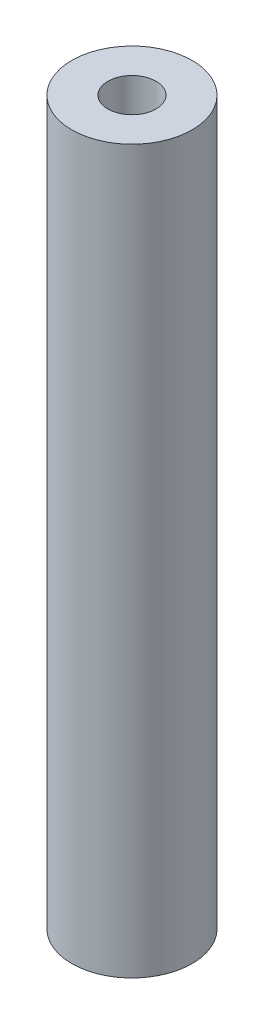
ISO-10303-21;
HEADER;
FILE_DESCRIPTION(('STEP AP214'),'2;1');
FILE_NAME('part.step','',(''),(''),'','','');
FILE_SCHEMA(('AUTOMOTIVE_DESIGN { 1 0 10303 214 1 1 1 1 }'));
ENDSEC;
DATA;
#1=APPLICATION_CONTEXT('core data for automotive mechanical design processes');
#2=APPLICATION_PROTOCOL_DEFINITION('international standard','automotive_design',2000,#1);
#3=PRODUCT_CONTEXT('',#1,'mechanical');
#4=PRODUCT('Part','Part','',(#3));
#5=PRODUCT_RELATED_PRODUCT_CATEGORY('part','',(#4));
#6=PRODUCT_DEFINITION_FORMATION('','',#4);
#7=PRODUCT_DEFINITION_CONTEXT('part definition',#1,'design');
#8=PRODUCT_DEFINITION('design','',#6,#7);
#9=PRODUCT_DEFINITION_SHAPE('','',#8);
#10=(LENGTH_UNIT() NAMED_UNIT(*) SI_UNIT(.MILLI.,.METRE.));
#11=(NAMED_UNIT(*) PLANE_ANGLE_UNIT() SI_UNIT($,.RADIAN.));
#12=(NAMED_UNIT(*) SI_UNIT($,.STERADIAN.) SOLID_ANGLE_UNIT());
#13=UNCERTAINTY_MEASURE_WITH_UNIT(LENGTH_MEASURE(1.E-05),#10,'distance_accuracy_value','');
#14=(GEOMETRIC_REPRESENTATION_CONTEXT(3) GLOBAL_UNCERTAINTY_ASSIGNED_CONTEXT((#13)) GLOBAL_UNIT_ASSIGNED_CONTEXT((#10,
#11,#12)) REPRESENTATION_CONTEXT('',''));
#15=CARTESIAN_POINT('',(0.,0.,0.));
#16=DIRECTION('',(0.,0.,1.));
#17=DIRECTION('',(1.,0.,0.));
#18=AXIS2_PLACEMENT_3D('',#15,#16,#17);
#19=CARTESIAN_POINT('',(0.,30.,0.));
#20=DIRECTION('',(0.,1.,0.));
#21=DIRECTION('',(0.,0.,1.));
#22=AXIS2_PLACEMENT_3D('',#19,#20,#21);
#23=PLANE('',#22);
#24=CARTESIAN_POINT('',(0.,30.,0.));
#25=DIRECTION('',(0.,1.,0.));
#26=DIRECTION('',(0.,0.,1.));
#27=AXIS2_PLACEMENT_3D('',#24,#25,#26);
#28=CIRCLE('',#27,2.5);
#29=CARTESIAN_POINT('',(0.,30.,2.5));
#30=VERTEX_POINT('',#29);
#31=EDGE_CURVE('E10',#30,#30,#28,.T.);
#32=ORIENTED_EDGE('',*,*,#31,.T.);
#33=EDGE_LOOP('',(#32));
#34=FACE_BOUND('',#33,.T.);
#35=CARTESIAN_POINT('',(0.,30.,0.));
#36=DIRECTION('',(0.,1.,0.));
#37=DIRECTION('',(0.,0.,1.));
#38=AXIS2_PLACEMENT_3D('',#35,#36,#37);
#39=CIRCLE('',#38,1.);
#40=CARTESIAN_POINT('',(0.,30.,1.));
#41=VERTEX_POINT('',#40);
#42=EDGE_CURVE('E48',#41,#41,#39,.T.);
#43=ORIENTED_EDGE('',*,*,#42,.F.);
#44=EDGE_LOOP('',(#43));
#45=FACE_BOUND('',#44,.T.);
#46=ADVANCED_FACE('F37',(#34,#45),#23,.T.);
#47=CARTESIAN_POINT('',(0.,0.,0.));
#48=DIRECTION('',(0.,1.,0.));
#49=DIRECTION('',(0.,0.,1.));
#50=AXIS2_PLACEMENT_3D('',#47,#48,#49);
#51=PLANE('',#50);
#52=CARTESIAN_POINT('',(0.,0.,0.));
#53=DIRECTION('',(0.,1.,0.));
#54=DIRECTION('',(0.,0.,1.));
#55=AXIS2_PLACEMENT_3D('',#52,#53,#54);
#56=CIRCLE('',#55,2.5);
#57=CARTESIAN_POINT('',(0.,0.,2.5));
#58=VERTEX_POINT('',#57);
#59=EDGE_CURVE('E41',#58,#58,#56,.T.);
#60=ORIENTED_EDGE('',*,*,#59,.F.);
#61=EDGE_LOOP('',(#60));
#62=FACE_BOUND('',#61,.T.);
#63=CARTESIAN_POINT('',(0.,0.,0.));
#64=DIRECTION('',(0.,1.,0.));
#65=DIRECTION('',(0.,0.,1.));
#66=AXIS2_PLACEMENT_3D('',#63,#64,#65);
#67=CIRCLE('',#66,1.);
#68=CARTESIAN_POINT('',(0.,0.,1.));
#69=VERTEX_POINT('',#68);
#70=EDGE_CURVE('E50',#69,#69,#67,.T.);
#71=ORIENTED_EDGE('',*,*,#70,.T.);
#72=EDGE_LOOP('',(#71));
#73=FACE_BOUND('',#72,.T.);
#74=ADVANCED_FACE('F60',(#62,#73),#51,.F.);
#75=CARTESIAN_POINT('',(0.,30.,0.));
#76=DIRECTION('',(0.,-1.,0.));
#77=DIRECTION('',(0.,0.,-1.));
#78=AXIS2_PLACEMENT_3D('',#75,#76,#77);
#79=CYLINDRICAL_SURFACE('',#78,2.5);
#80=ORIENTED_EDGE('',*,*,#31,.F.);
#81=EDGE_LOOP('',(#80));
#82=FACE_BOUND('',#81,.T.);
#83=ORIENTED_EDGE('',*,*,#59,.T.);
#84=EDGE_LOOP('',(#83));
#85=FACE_BOUND('',#84,.T.);
#86=ADVANCED_FACE('F39',(#82,#85),#79,.T.);
#87=CARTESIAN_POINT('',(0.,30.,0.));
#88=DIRECTION('',(0.,-1.,0.));
#89=DIRECTION('',(0.,0.,-1.));
#90=AXIS2_PLACEMENT_3D('',#87,#88,#89);
#91=CYLINDRICAL_SURFACE('',#90,1.);
#92=ORIENTED_EDGE('',*,*,#42,.T.);
#93=EDGE_LOOP('',(#92));
#94=FACE_BOUND('',#93,.T.);
#95=ORIENTED_EDGE('',*,*,#70,.F.);
#96=EDGE_LOOP('',(#95));
#97=FACE_BOUND('',#96,.T.);
#98=ADVANCED_FACE('F56',(#94,#97),#91,.F.);
#99=CLOSED_SHELL('',(#46,#74,#86,#98));
#100=MANIFOLD_SOLID_BREP('B2',#99);
#101=ADVANCED_BREP_SHAPE_REPRESENTATION('',(#18,#100),#14);
#102=SHAPE_DEFINITION_REPRESENTATION(#9,#101);
ENDSEC;
END-ISO-10303-21;
